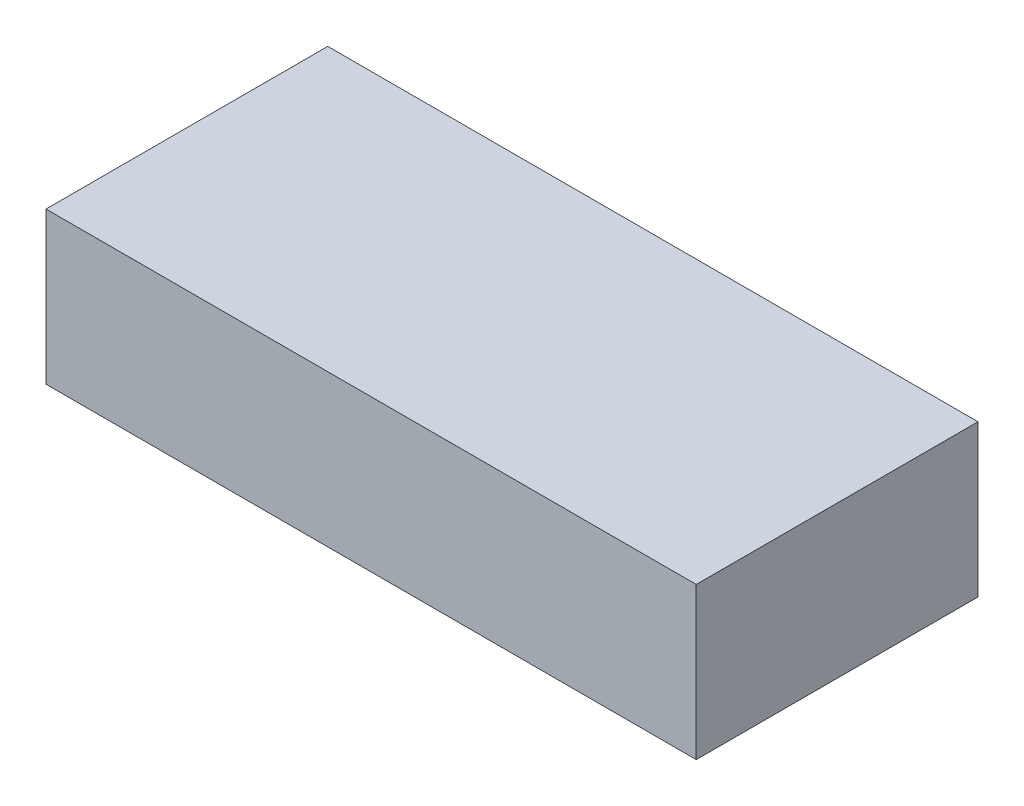
ISO-10303-21;
HEADER;
FILE_DESCRIPTION(('STEP AP214'),'2;1');
FILE_NAME('part.step','',(''),(''),'','','');
FILE_SCHEMA(('AUTOMOTIVE_DESIGN { 1 0 10303 214 1 1 1 1 }'));
ENDSEC;
DATA;
#1=APPLICATION_CONTEXT('core data for automotive mechanical design processes');
#2=APPLICATION_PROTOCOL_DEFINITION('international standard','automotive_design',2000,#1);
#3=PRODUCT_CONTEXT('',#1,'mechanical');
#4=PRODUCT('Part','Part','',(#3));
#5=PRODUCT_RELATED_PRODUCT_CATEGORY('part','',(#4));
#6=PRODUCT_DEFINITION_FORMATION('','',#4);
#7=PRODUCT_DEFINITION_CONTEXT('part definition',#1,'design');
#8=PRODUCT_DEFINITION('design','',#6,#7);
#9=PRODUCT_DEFINITION_SHAPE('','',#8);
#10=(LENGTH_UNIT() NAMED_UNIT(*) SI_UNIT(.MILLI.,.METRE.));
#11=(NAMED_UNIT(*) PLANE_ANGLE_UNIT() SI_UNIT($,.RADIAN.));
#12=(NAMED_UNIT(*) SI_UNIT($,.STERADIAN.) SOLID_ANGLE_UNIT());
#13=UNCERTAINTY_MEASURE_WITH_UNIT(LENGTH_MEASURE(1.E-05),#10,'distance_accuracy_value','');
#14=(GEOMETRIC_REPRESENTATION_CONTEXT(3) GLOBAL_UNCERTAINTY_ASSIGNED_CONTEXT((#13)) GLOBAL_UNIT_ASSIGNED_CONTEXT((#10,
#11,#12)) REPRESENTATION_CONTEXT('',''));
#15=CARTESIAN_POINT('',(0.,0.,0.));
#16=DIRECTION('',(0.,0.,1.));
#17=DIRECTION('',(1.,0.,0.));
#18=AXIS2_PLACEMENT_3D('',#15,#16,#17);
#19=CARTESIAN_POINT('',(75.,35.,32.5));
#20=DIRECTION('',(-1.,0.,0.));
#21=DIRECTION('',(0.,0.,1.));
#22=AXIS2_PLACEMENT_3D('',#19,#20,#21);
#23=PLANE('',#22);
#24=DIRECTION('',(0.,0.,-1.));
#25=VECTOR('',#24,1.);
#26=CARTESIAN_POINT('',(75.,0.,32.5));
#27=LINE('',#26,#25);
#28=CARTESIAN_POINT('',(75.,0.,32.5));
#29=VERTEX_POINT('',#28);
#30=CARTESIAN_POINT('',(75.,0.,-32.5));
#31=VERTEX_POINT('',#30);
#32=EDGE_CURVE('E162',#29,#31,#27,.T.);
#33=ORIENTED_EDGE('',*,*,#32,.T.);
#34=DIRECTION('',(0.,-1.,0.));
#35=VECTOR('',#34,1.);
#36=CARTESIAN_POINT('',(75.,35.,-32.5));
#37=LINE('',#36,#35);
#38=CARTESIAN_POINT('',(75.,35.,-32.5));
#39=VERTEX_POINT('',#38);
#40=EDGE_CURVE('E11',#39,#31,#37,.T.);
#41=ORIENTED_EDGE('',*,*,#40,.F.);
#42=DIRECTION('',(0.,0.,-1.));
#43=VECTOR('',#42,1.);
#44=CARTESIAN_POINT('',(75.,35.,32.5));
#45=LINE('',#44,#43);
#46=CARTESIAN_POINT('',(75.,35.,32.5));
#47=VERTEX_POINT('',#46);
#48=EDGE_CURVE('E168',#47,#39,#45,.T.);
#49=ORIENTED_EDGE('',*,*,#48,.F.);
#50=DIRECTION('',(0.,-1.,0.));
#51=VECTOR('',#50,1.);
#52=CARTESIAN_POINT('',(75.,35.,32.5));
#53=LINE('',#52,#51);
#54=EDGE_CURVE('E178',#47,#29,#53,.T.);
#55=ORIENTED_EDGE('',*,*,#54,.T.);
#56=EDGE_LOOP('',(#33,#41,#49,#55));
#57=FACE_BOUND('',#56,.T.);
#58=ADVANCED_FACE('F43',(#57),#23,.F.);
#59=CARTESIAN_POINT('',(-75.,35.,-32.5));
#60=DIRECTION('',(0.,0.,1.));
#61=DIRECTION('',(1.,0.,0.));
#62=AXIS2_PLACEMENT_3D('',#59,#60,#61);
#63=PLANE('',#62);
#64=DIRECTION('',(-1.,0.,0.));
#65=VECTOR('',#64,1.);
#66=CARTESIAN_POINT('',(-75.,0.,-32.5));
#67=LINE('',#66,#65);
#68=CARTESIAN_POINT('',(-75.,0.,-32.5));
#69=VERTEX_POINT('',#68);
#70=EDGE_CURVE('E182',#31,#69,#67,.T.);
#71=ORIENTED_EDGE('',*,*,#70,.T.);
#72=DIRECTION('',(0.,-1.,0.));
#73=VECTOR('',#72,1.);
#74=CARTESIAN_POINT('',(-75.,35.,-32.5));
#75=LINE('',#74,#73);
#76=CARTESIAN_POINT('',(-75.,35.,-32.5));
#77=VERTEX_POINT('',#76);
#78=EDGE_CURVE('E51',#77,#69,#75,.T.);
#79=ORIENTED_EDGE('',*,*,#78,.F.);
#80=DIRECTION('',(-1.,0.,0.));
#81=VECTOR('',#80,1.);
#82=CARTESIAN_POINT('',(-75.,35.,-32.5));
#83=LINE('',#82,#81);
#84=EDGE_CURVE('E95',#39,#77,#83,.T.);
#85=ORIENTED_EDGE('',*,*,#84,.F.);
#86=ORIENTED_EDGE('',*,*,#40,.T.);
#87=EDGE_LOOP('',(#71,#79,#85,#86));
#88=FACE_BOUND('',#87,.T.);
#89=ADVANCED_FACE('F216',(#88),#63,.F.);
#90=CARTESIAN_POINT('',(-75.,35.,32.5));
#91=DIRECTION('',(1.,0.,0.));
#92=DIRECTION('',(0.,0.,-1.));
#93=AXIS2_PLACEMENT_3D('',#90,#91,#92);
#94=PLANE('',#93);
#95=DIRECTION('',(0.,0.,1.));
#96=VECTOR('',#95,1.);
#97=CARTESIAN_POINT('',(-75.,0.,32.5));
#98=LINE('',#97,#96);
#99=CARTESIAN_POINT('',(-75.,0.,32.5));
#100=VERTEX_POINT('',#99);
#101=EDGE_CURVE('E185',#69,#100,#98,.T.);
#102=ORIENTED_EDGE('',*,*,#101,.T.);
#103=DIRECTION('',(0.,-1.,0.));
#104=VECTOR('',#103,1.);
#105=CARTESIAN_POINT('',(-75.,35.,32.5));
#106=LINE('',#105,#104);
#107=CARTESIAN_POINT('',(-75.,35.,32.5));
#108=VERTEX_POINT('',#107);
#109=EDGE_CURVE('E192',#108,#100,#106,.T.);
#110=ORIENTED_EDGE('',*,*,#109,.F.);
#111=DIRECTION('',(0.,0.,1.));
#112=VECTOR('',#111,1.);
#113=CARTESIAN_POINT('',(-75.,35.,32.5));
#114=LINE('',#113,#112);
#115=EDGE_CURVE('E173',#77,#108,#114,.T.);
#116=ORIENTED_EDGE('',*,*,#115,.F.);
#117=ORIENTED_EDGE('',*,*,#78,.T.);
#118=EDGE_LOOP('',(#102,#110,#116,#117));
#119=FACE_BOUND('',#118,.T.);
#120=ADVANCED_FACE('F199',(#119),#94,.F.);
#121=CARTESIAN_POINT('',(-75.,35.,32.5));
#122=DIRECTION('',(0.,0.,-1.));
#123=DIRECTION('',(-1.,0.,0.));
#124=AXIS2_PLACEMENT_3D('',#121,#122,#123);
#125=PLANE('',#124);
#126=DIRECTION('',(1.,0.,0.));
#127=VECTOR('',#126,1.);
#128=CARTESIAN_POINT('',(-75.,0.,32.5));
#129=LINE('',#128,#127);
#130=EDGE_CURVE('E88',#100,#29,#129,.T.);
#131=ORIENTED_EDGE('',*,*,#130,.T.);
#132=ORIENTED_EDGE('',*,*,#54,.F.);
#133=DIRECTION('',(1.,0.,0.));
#134=VECTOR('',#133,1.);
#135=CARTESIAN_POINT('',(-75.,35.,32.5));
#136=LINE('',#135,#134);
#137=EDGE_CURVE('E67',#108,#47,#136,.T.);
#138=ORIENTED_EDGE('',*,*,#137,.F.);
#139=ORIENTED_EDGE('',*,*,#109,.T.);
#140=EDGE_LOOP('',(#131,#132,#138,#139));
#141=FACE_BOUND('',#140,.T.);
#142=ADVANCED_FACE('F207',(#141),#125,.F.);
#143=CARTESIAN_POINT('',(0.,35.,0.));
#144=DIRECTION('',(0.,-1.,0.));
#145=DIRECTION('',(0.,0.,-1.));
#146=AXIS2_PLACEMENT_3D('',#143,#144,#145);
#147=PLANE('',#146);
#148=ORIENTED_EDGE('',*,*,#48,.T.);
#149=ORIENTED_EDGE('',*,*,#84,.T.);
#150=ORIENTED_EDGE('',*,*,#115,.T.);
#151=ORIENTED_EDGE('',*,*,#137,.T.);
#152=EDGE_LOOP('',(#148,#149,#150,#151));
#153=FACE_BOUND('',#152,.T.);
#154=ADVANCED_FACE('F209',(#153),#147,.F.);
#155=CARTESIAN_POINT('',(0.,0.,0.));
#156=DIRECTION('',(0.,-1.,0.));
#157=DIRECTION('',(0.,0.,-1.));
#158=AXIS2_PLACEMENT_3D('',#155,#156,#157);
#159=PLANE('',#158);
#160=DIRECTION('',(0.,0.,1.));
#161=VECTOR('',#160,1.);
#162=CARTESIAN_POINT('',(71.952,0.,-29.452));
#163=LINE('',#162,#161);
#164=CARTESIAN_POINT('',(71.952,0.,-29.452));
#165=VERTEX_POINT('',#164);
#166=CARTESIAN_POINT('',(71.952,0.,29.452));
#167=VERTEX_POINT('',#166);
#168=EDGE_CURVE('E58',#165,#167,#163,.T.);
#169=ORIENTED_EDGE('',*,*,#168,.F.);
#170=DIRECTION('',(1.,0.,0.));
#171=VECTOR('',#170,1.);
#172=CARTESIAN_POINT('',(-71.952,0.,-29.452));
#173=LINE('',#172,#171);
#174=CARTESIAN_POINT('',(-71.952,0.,-29.452));
#175=VERTEX_POINT('',#174);
#176=EDGE_CURVE('E140',#175,#165,#173,.T.);
#177=ORIENTED_EDGE('',*,*,#176,.F.);
#178=DIRECTION('',(0.,0.,-1.));
#179=VECTOR('',#178,1.);
#180=CARTESIAN_POINT('',(-71.952,0.,-29.452));
#181=LINE('',#180,#179);
#182=CARTESIAN_POINT('',(-71.952,0.,29.452));
#183=VERTEX_POINT('',#182);
#184=EDGE_CURVE('E144',#183,#175,#181,.T.);
#185=ORIENTED_EDGE('',*,*,#184,.F.);
#186=DIRECTION('',(-1.,0.,0.));
#187=VECTOR('',#186,1.);
#188=CARTESIAN_POINT('',(-71.952,0.,29.452));
#189=LINE('',#188,#187);
#190=EDGE_CURVE('E153',#167,#183,#189,.T.);
#191=ORIENTED_EDGE('',*,*,#190,.F.);
#192=EDGE_LOOP('',(#169,#177,#185,#191));
#193=FACE_BOUND('',#192,.T.);
#194=ORIENTED_EDGE('',*,*,#32,.F.);
#195=ORIENTED_EDGE('',*,*,#130,.F.);
#196=ORIENTED_EDGE('',*,*,#101,.F.);
#197=ORIENTED_EDGE('',*,*,#70,.F.);
#198=EDGE_LOOP('',(#194,#195,#196,#197));
#199=FACE_BOUND('',#198,.T.);
#200=ADVANCED_FACE('F203',(#193,#199),#159,.T.);
#201=CARTESIAN_POINT('',(71.952,28.4,-29.452));
#202=DIRECTION('',(1.,0.,0.));
#203=DIRECTION('',(0.,0.,-1.));
#204=AXIS2_PLACEMENT_3D('',#201,#202,#203);
#205=PLANE('',#204);
#206=ORIENTED_EDGE('',*,*,#168,.T.);
#207=DIRECTION('',(0.,-1.,0.));
#208=VECTOR('',#207,1.);
#209=CARTESIAN_POINT('',(71.952,28.4,29.452));
#210=LINE('',#209,#208);
#211=CARTESIAN_POINT('',(71.952,28.4,29.452));
#212=VERTEX_POINT('',#211);
#213=EDGE_CURVE('E115',#212,#167,#210,.T.);
#214=ORIENTED_EDGE('',*,*,#213,.F.);
#215=DIRECTION('',(0.,0.,1.));
#216=VECTOR('',#215,1.);
#217=CARTESIAN_POINT('',(71.952,28.4,-29.452));
#218=LINE('',#217,#216);
#219=CARTESIAN_POINT('',(71.952,28.4,-29.452));
#220=VERTEX_POINT('',#219);
#221=EDGE_CURVE('E119',#220,#212,#218,.T.);
#222=ORIENTED_EDGE('',*,*,#221,.F.);
#223=DIRECTION('',(0.,-1.,0.));
#224=VECTOR('',#223,1.);
#225=CARTESIAN_POINT('',(71.952,28.4,-29.452));
#226=LINE('',#225,#224);
#227=EDGE_CURVE('E159',#220,#165,#226,.T.);
#228=ORIENTED_EDGE('',*,*,#227,.T.);
#229=EDGE_LOOP('',(#206,#214,#222,#228));
#230=FACE_BOUND('',#229,.T.);
#231=ADVANCED_FACE('F117',(#230),#205,.F.);
#232=CARTESIAN_POINT('',(-71.952,28.4,-29.452));
#233=DIRECTION('',(0.,0.,-1.));
#234=DIRECTION('',(-1.,0.,0.));
#235=AXIS2_PLACEMENT_3D('',#232,#233,#234);
#236=PLANE('',#235);
#237=ORIENTED_EDGE('',*,*,#176,.T.);
#238=ORIENTED_EDGE('',*,*,#227,.F.);
#239=DIRECTION('',(1.,0.,0.));
#240=VECTOR('',#239,1.);
#241=CARTESIAN_POINT('',(-71.952,28.4,-29.452));
#242=LINE('',#241,#240);
#243=CARTESIAN_POINT('',(-71.952,28.4,-29.452));
#244=VERTEX_POINT('',#243);
#245=EDGE_CURVE('E126',#244,#220,#242,.T.);
#246=ORIENTED_EDGE('',*,*,#245,.F.);
#247=DIRECTION('',(0.,-1.,0.));
#248=VECTOR('',#247,1.);
#249=CARTESIAN_POINT('',(-71.952,28.4,-29.452));
#250=LINE('',#249,#248);
#251=EDGE_CURVE('E163',#244,#175,#250,.T.);
#252=ORIENTED_EDGE('',*,*,#251,.T.);
#253=EDGE_LOOP('',(#237,#238,#246,#252));
#254=FACE_BOUND('',#253,.T.);
#255=ADVANCED_FACE('F260',(#254),#236,.F.);
#256=CARTESIAN_POINT('',(-71.952,28.4,-29.452));
#257=DIRECTION('',(-1.,0.,0.));
#258=DIRECTION('',(0.,0.,1.));
#259=AXIS2_PLACEMENT_3D('',#256,#257,#258);
#260=PLANE('',#259);
#261=ORIENTED_EDGE('',*,*,#184,.T.);
#262=ORIENTED_EDGE('',*,*,#251,.F.);
#263=DIRECTION('',(0.,0.,-1.));
#264=VECTOR('',#263,1.);
#265=CARTESIAN_POINT('',(-71.952,28.4,-29.452));
#266=LINE('',#265,#264);
#267=CARTESIAN_POINT('',(-71.952,28.4,29.452));
#268=VERTEX_POINT('',#267);
#269=EDGE_CURVE('E135',#268,#244,#266,.T.);
#270=ORIENTED_EDGE('',*,*,#269,.F.);
#271=DIRECTION('',(0.,-1.,0.));
#272=VECTOR('',#271,1.);
#273=CARTESIAN_POINT('',(-71.952,28.4,29.452));
#274=LINE('',#273,#272);
#275=EDGE_CURVE('E125',#268,#183,#274,.T.);
#276=ORIENTED_EDGE('',*,*,#275,.T.);
#277=EDGE_LOOP('',(#261,#262,#270,#276));
#278=FACE_BOUND('',#277,.T.);
#279=ADVANCED_FACE('F270',(#278),#260,.F.);
#280=CARTESIAN_POINT('',(-71.952,28.4,29.452));
#281=DIRECTION('',(0.,0.,1.));
#282=DIRECTION('',(1.,0.,0.));
#283=AXIS2_PLACEMENT_3D('',#280,#281,#282);
#284=PLANE('',#283);
#285=ORIENTED_EDGE('',*,*,#190,.T.);
#286=ORIENTED_EDGE('',*,*,#275,.F.);
#287=DIRECTION('',(-1.,0.,0.));
#288=VECTOR('',#287,1.);
#289=CARTESIAN_POINT('',(-71.952,28.4,29.452));
#290=LINE('',#289,#288);
#291=EDGE_CURVE('E129',#212,#268,#290,.T.);
#292=ORIENTED_EDGE('',*,*,#291,.F.);
#293=ORIENTED_EDGE('',*,*,#213,.T.);
#294=EDGE_LOOP('',(#285,#286,#292,#293));
#295=FACE_BOUND('',#294,.T.);
#296=ADVANCED_FACE('F130',(#295),#284,.F.);
#297=CARTESIAN_POINT('',(0.,28.4,0.));
#298=DIRECTION('',(0.,1.,0.));
#299=DIRECTION('',(0.,0.,1.));
#300=AXIS2_PLACEMENT_3D('',#297,#298,#299);
#301=PLANE('',#300);
#302=ORIENTED_EDGE('',*,*,#221,.T.);
#303=ORIENTED_EDGE('',*,*,#291,.T.);
#304=ORIENTED_EDGE('',*,*,#269,.T.);
#305=ORIENTED_EDGE('',*,*,#245,.T.);
#306=EDGE_LOOP('',(#302,#303,#304,#305));
#307=FACE_BOUND('',#306,.T.);
#308=ADVANCED_FACE('F137',(#307),#301,.F.);
#309=CLOSED_SHELL('',(#58,#89,#120,#142,#154,#200,#231,#255,#279,#296,#308));
#310=MANIFOLD_SOLID_BREP('B2',#309);
#311=ADVANCED_BREP_SHAPE_REPRESENTATION('',(#18,#310),#14);
#312=SHAPE_DEFINITION_REPRESENTATION(#9,#311);
ENDSEC;
END-ISO-10303-21;
